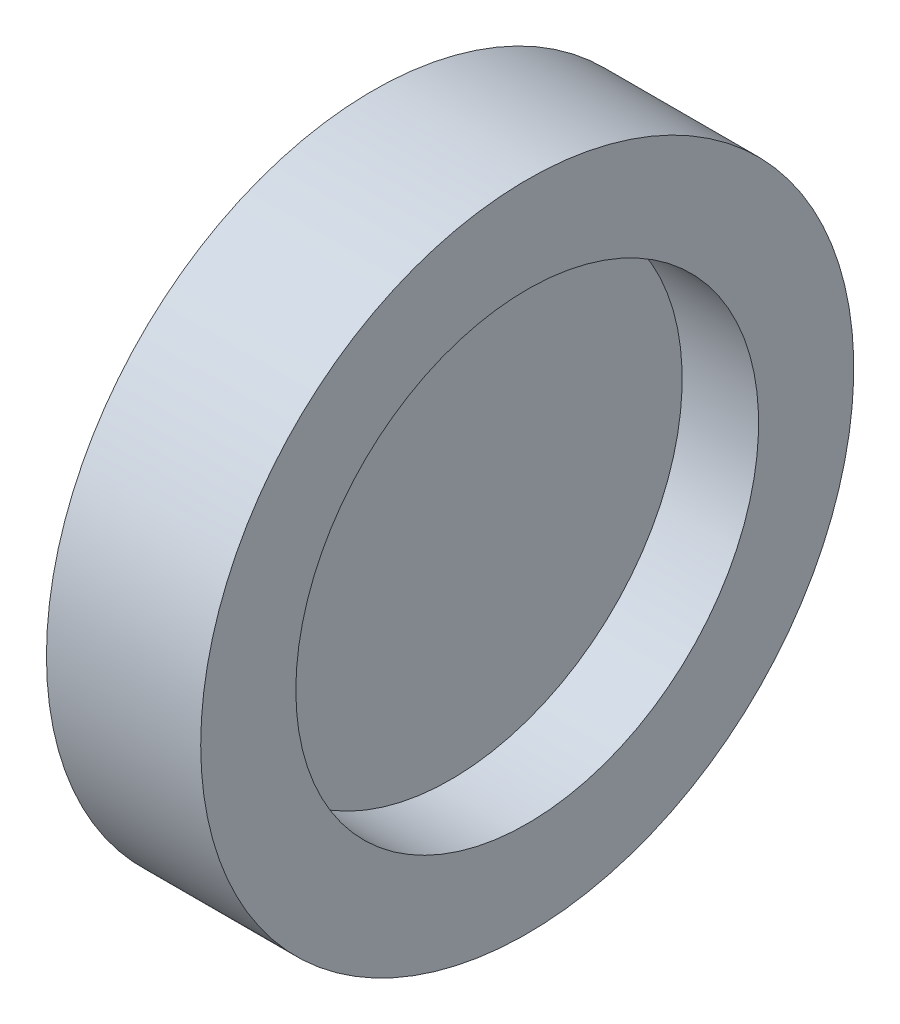
ISO-10303-21;
HEADER;
FILE_DESCRIPTION(('STEP AP214'),'2;1');
FILE_NAME('part.step','',(''),(''),'','','');
FILE_SCHEMA(('AUTOMOTIVE_DESIGN { 1 0 10303 214 1 1 1 1 }'));
ENDSEC;
DATA;
#1=APPLICATION_CONTEXT('core data for automotive mechanical design processes');
#2=APPLICATION_PROTOCOL_DEFINITION('international standard','automotive_design',2000,#1);
#3=PRODUCT_CONTEXT('',#1,'mechanical');
#4=PRODUCT('Part','Part','',(#3));
#5=PRODUCT_RELATED_PRODUCT_CATEGORY('part','',(#4));
#6=PRODUCT_DEFINITION_FORMATION('','',#4);
#7=PRODUCT_DEFINITION_CONTEXT('part definition',#1,'design');
#8=PRODUCT_DEFINITION('design','',#6,#7);
#9=PRODUCT_DEFINITION_SHAPE('','',#8);
#10=(LENGTH_UNIT() NAMED_UNIT(*) SI_UNIT(.MILLI.,.METRE.));
#11=(NAMED_UNIT(*) PLANE_ANGLE_UNIT() SI_UNIT($,.RADIAN.));
#12=(NAMED_UNIT(*) SI_UNIT($,.STERADIAN.) SOLID_ANGLE_UNIT());
#13=UNCERTAINTY_MEASURE_WITH_UNIT(LENGTH_MEASURE(1.E-05),#10,'distance_accuracy_value','');
#14=(GEOMETRIC_REPRESENTATION_CONTEXT(3) GLOBAL_UNCERTAINTY_ASSIGNED_CONTEXT((#13)) GLOBAL_UNIT_ASSIGNED_CONTEXT((#10,
#11,#12)) REPRESENTATION_CONTEXT('',''));
#15=CARTESIAN_POINT('',(0.,0.,0.));
#16=DIRECTION('',(0.,0.,1.));
#17=DIRECTION('',(1.,0.,0.));
#18=AXIS2_PLACEMENT_3D('',#15,#16,#17);
#19=CARTESIAN_POINT('',(0.0270000000000005,9.,0.));
#20=DIRECTION('',(-1.,0.,0.));
#21=DIRECTION('',(0.,0.,1.));
#22=AXIS2_PLACEMENT_3D('',#19,#20,#21);
#23=PLANE('',#22);
#24=CARTESIAN_POINT('',(0.0270000000000011,0.,0.));
#25=DIRECTION('',(-1.,0.,0.));
#26=DIRECTION('',(0.,0.,1.));
#27=AXIS2_PLACEMENT_3D('',#24,#25,#26);
#28=CIRCLE('',#27,9.);
#29=CARTESIAN_POINT('',(0.0270000000000011,0.,9.));
#30=VERTEX_POINT('',#29);
#31=EDGE_CURVE('E10',#30,#30,#28,.T.);
#32=ORIENTED_EDGE('',*,*,#31,.F.);
#33=EDGE_LOOP('',(#32));
#34=FACE_BOUND('',#33,.T.);
#35=ADVANCED_FACE('F37',(#34),#23,.F.);
#36=CARTESIAN_POINT('',(-1.61421241885762,0.,0.));
#37=DIRECTION('',(-1.,0.,0.));
#38=DIRECTION('',(0.,0.,1.));
#39=AXIS2_PLACEMENT_3D('',#36,#37,#38);
#40=CYLINDRICAL_SURFACE('',#39,9.);
#41=CARTESIAN_POINT('',(3.,0.,0.));
#42=DIRECTION('',(-1.,0.,0.));
#43=DIRECTION('',(0.,0.,1.));
#44=AXIS2_PLACEMENT_3D('',#41,#42,#43);
#45=CIRCLE('',#44,9.);
#46=CARTESIAN_POINT('',(3.,0.,9.));
#47=VERTEX_POINT('',#46);
#48=EDGE_CURVE('E60',#47,#47,#45,.T.);
#49=ORIENTED_EDGE('',*,*,#48,.F.);
#50=EDGE_LOOP('',(#49));
#51=FACE_BOUND('',#50,.T.);
#52=ORIENTED_EDGE('',*,*,#31,.T.);
#53=EDGE_LOOP('',(#52));
#54=FACE_BOUND('',#53,.T.);
#55=ADVANCED_FACE('F90',(#51,#54),#40,.F.);
#56=CARTESIAN_POINT('',(-3.,0.,0.));
#57=DIRECTION('',(-1.,0.,0.));
#58=DIRECTION('',(0.,0.,1.));
#59=AXIS2_PLACEMENT_3D('',#56,#57,#58);
#60=CIRCLE('',#59,9.);
#61=CARTESIAN_POINT('',(-3.,0.,9.));
#62=VERTEX_POINT('',#61);
#63=EDGE_CURVE('E64',#62,#62,#60,.T.);
#64=ORIENTED_EDGE('',*,*,#63,.T.);
#65=EDGE_LOOP('',(#64));
#66=FACE_BOUND('',#65,.T.);
#67=CARTESIAN_POINT('',(-0.0270000000000005,0.,0.));
#68=DIRECTION('',(1.,0.,0.));
#69=DIRECTION('',(0.,0.,-1.));
#70=AXIS2_PLACEMENT_3D('',#67,#68,#69);
#71=CIRCLE('',#70,9.);
#72=CARTESIAN_POINT('',(-0.0270000000000005,0.,-9.));
#73=VERTEX_POINT('',#72);
#74=EDGE_CURVE('E44',#73,#73,#71,.T.);
#75=ORIENTED_EDGE('',*,*,#74,.T.);
#76=EDGE_LOOP('',(#75));
#77=FACE_BOUND('',#76,.T.);
#78=ADVANCED_FACE('F69',(#66,#77),#40,.F.);
#79=CARTESIAN_POINT('',(-3.,9.,0.));
#80=DIRECTION('',(1.,0.,0.));
#81=DIRECTION('',(0.,0.,-1.));
#82=AXIS2_PLACEMENT_3D('',#79,#80,#81);
#83=PLANE('',#82);
#84=ORIENTED_EDGE('',*,*,#63,.F.);
#85=EDGE_LOOP('',(#84));
#86=FACE_BOUND('',#85,.T.);
#87=CARTESIAN_POINT('',(-3.,0.,0.));
#88=DIRECTION('',(-1.,0.,0.));
#89=DIRECTION('',(0.,0.,1.));
#90=AXIS2_PLACEMENT_3D('',#87,#88,#89);
#91=CIRCLE('',#90,12.7);
#92=CARTESIAN_POINT('',(-3.,0.,12.7));
#93=VERTEX_POINT('',#92);
#94=EDGE_CURVE('E49',#93,#93,#91,.T.);
#95=ORIENTED_EDGE('',*,*,#94,.T.);
#96=EDGE_LOOP('',(#95));
#97=FACE_BOUND('',#96,.T.);
#98=ADVANCED_FACE('F71',(#86,#97),#83,.F.);
#99=CARTESIAN_POINT('',(-1.61421241885762,0.,0.));
#100=DIRECTION('',(-1.,0.,0.));
#101=DIRECTION('',(0.,0.,1.));
#102=AXIS2_PLACEMENT_3D('',#99,#100,#101);
#103=CYLINDRICAL_SURFACE('',#102,12.7);
#104=ORIENTED_EDGE('',*,*,#94,.F.);
#105=EDGE_LOOP('',(#104));
#106=FACE_BOUND('',#105,.T.);
#107=CARTESIAN_POINT('',(3.,0.,0.));
#108=DIRECTION('',(-1.,0.,0.));
#109=DIRECTION('',(0.,0.,1.));
#110=AXIS2_PLACEMENT_3D('',#107,#108,#109);
#111=CIRCLE('',#110,12.7);
#112=CARTESIAN_POINT('',(3.,0.,12.7));
#113=VERTEX_POINT('',#112);
#114=EDGE_CURVE('E54',#113,#113,#111,.T.);
#115=ORIENTED_EDGE('',*,*,#114,.T.);
#116=EDGE_LOOP('',(#115));
#117=FACE_BOUND('',#116,.T.);
#118=ADVANCED_FACE('F74',(#106,#117),#103,.T.);
#119=CARTESIAN_POINT('',(3.,12.7,0.));
#120=DIRECTION('',(-1.,0.,0.));
#121=DIRECTION('',(0.,0.,1.));
#122=AXIS2_PLACEMENT_3D('',#119,#120,#121);
#123=PLANE('',#122);
#124=ORIENTED_EDGE('',*,*,#114,.F.);
#125=EDGE_LOOP('',(#124));
#126=FACE_BOUND('',#125,.T.);
#127=ORIENTED_EDGE('',*,*,#48,.T.);
#128=EDGE_LOOP('',(#127));
#129=FACE_BOUND('',#128,.T.);
#130=ADVANCED_FACE('F80',(#126,#129),#123,.F.);
#131=CARTESIAN_POINT('',(-0.0270000000000005,9.,0.));
#132=DIRECTION('',(1.,0.,0.));
#133=DIRECTION('',(0.,0.,-1.));
#134=AXIS2_PLACEMENT_3D('',#131,#132,#133);
#135=PLANE('',#134);
#136=ORIENTED_EDGE('',*,*,#74,.F.);
#137=EDGE_LOOP('',(#136));
#138=FACE_BOUND('',#137,.T.);
#139=ADVANCED_FACE('F86',(#138),#135,.F.);
#140=CLOSED_SHELL('',(#35,#55,#78,#98,#118,#130,#139));
#141=MANIFOLD_SOLID_BREP('B2',#140);
#142=ADVANCED_BREP_SHAPE_REPRESENTATION('',(#18,#141),#14);
#143=SHAPE_DEFINITION_REPRESENTATION(#9,#142);
ENDSEC;
END-ISO-10303-21;
